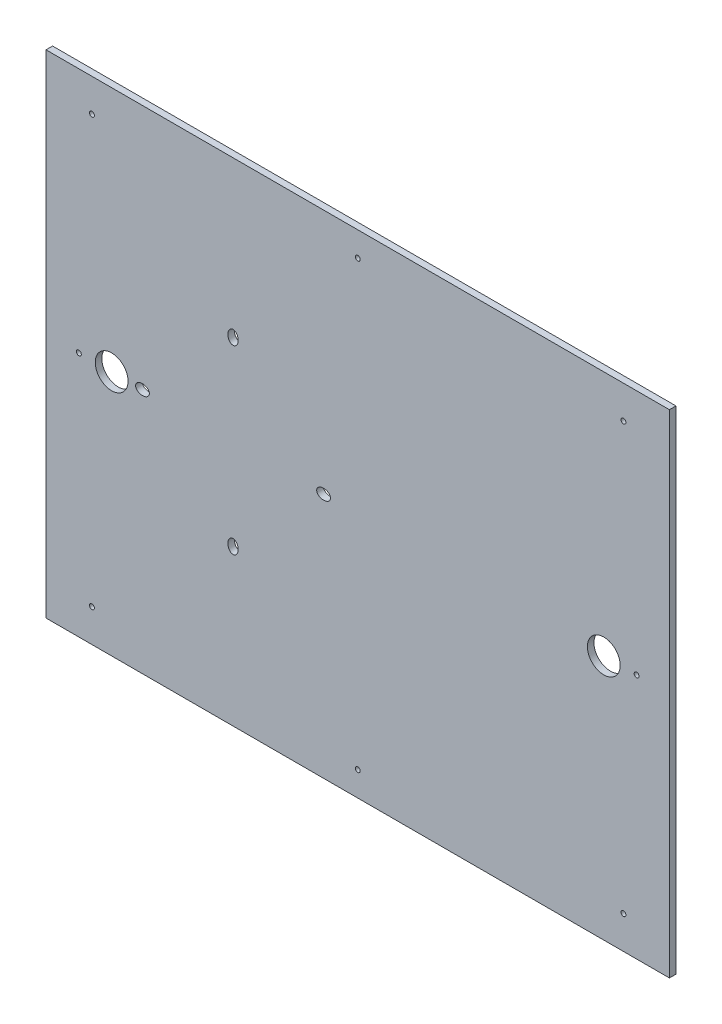
ISO-10303-21;
HEADER;
FILE_DESCRIPTION(('STEP AP214'),'2;1');
FILE_NAME('part.step','',(''),(''),'','','');
FILE_SCHEMA(('AUTOMOTIVE_DESIGN { 1 0 10303 214 1 1 1 1 }'));
ENDSEC;
DATA;
#1=APPLICATION_CONTEXT('core data for automotive mechanical design processes');
#2=APPLICATION_PROTOCOL_DEFINITION('international standard','automotive_design',2000,#1);
#3=PRODUCT_CONTEXT('',#1,'mechanical');
#4=PRODUCT('Part','Part','',(#3));
#5=PRODUCT_RELATED_PRODUCT_CATEGORY('part','',(#4));
#6=PRODUCT_DEFINITION_FORMATION('','',#4);
#7=PRODUCT_DEFINITION_CONTEXT('part definition',#1,'design');
#8=PRODUCT_DEFINITION('design','',#6,#7);
#9=PRODUCT_DEFINITION_SHAPE('','',#8);
#10=(LENGTH_UNIT() NAMED_UNIT(*) SI_UNIT(.MILLI.,.METRE.));
#11=(NAMED_UNIT(*) PLANE_ANGLE_UNIT() SI_UNIT($,.RADIAN.));
#12=(NAMED_UNIT(*) SI_UNIT($,.STERADIAN.) SOLID_ANGLE_UNIT());
#13=UNCERTAINTY_MEASURE_WITH_UNIT(LENGTH_MEASURE(1.E-05),#10,'distance_accuracy_value','');
#14=(GEOMETRIC_REPRESENTATION_CONTEXT(3) GLOBAL_UNCERTAINTY_ASSIGNED_CONTEXT((#13)) GLOBAL_UNIT_ASSIGNED_CONTEXT((#10,
#11,#12)) REPRESENTATION_CONTEXT('',''));
#15=CARTESIAN_POINT('',(0.,0.,0.));
#16=DIRECTION('',(0.,0.,1.));
#17=DIRECTION('',(1.,0.,0.));
#18=AXIS2_PLACEMENT_3D('',#15,#16,#17);
#19=CARTESIAN_POINT('',(-313.14988176555,-102.236334851958,4.));
#20=DIRECTION('',(1.,0.,0.));
#21=DIRECTION('',(0.,0.,-1.));
#22=AXIS2_PLACEMENT_3D('',#19,#20,#21);
#23=PLANE('',#22);
#24=DIRECTION('',(0.,-1.,0.));
#25=VECTOR('',#24,1.);
#26=CARTESIAN_POINT('',(-313.14988176555,-102.236334851958,0.));
#27=LINE('',#26,#25);
#28=CARTESIAN_POINT('',(-313.14988176555,197.763665148042,0.));
#29=VERTEX_POINT('',#28);
#30=CARTESIAN_POINT('',(-313.14988176555,-102.236334851958,0.));
#31=VERTEX_POINT('',#30);
#32=EDGE_CURVE('E98',#29,#31,#27,.T.);
#33=ORIENTED_EDGE('',*,*,#32,.T.);
#34=DIRECTION('',(0.,0.,-1.));
#35=VECTOR('',#34,1.);
#36=CARTESIAN_POINT('',(-313.14988176555,-102.236334851958,4.));
#37=LINE('',#36,#35);
#38=CARTESIAN_POINT('',(-313.14988176555,-102.236334851958,4.));
#39=VERTEX_POINT('',#38);
#40=EDGE_CURVE('E11',#39,#31,#37,.T.);
#41=ORIENTED_EDGE('',*,*,#40,.F.);
#42=DIRECTION('',(0.,-1.,0.));
#43=VECTOR('',#42,1.);
#44=CARTESIAN_POINT('',(-313.14988176555,-102.236334851958,4.));
#45=LINE('',#44,#43);
#46=CARTESIAN_POINT('',(-313.14988176555,197.763665148042,4.));
#47=VERTEX_POINT('',#46);
#48=EDGE_CURVE('E85',#47,#39,#45,.T.);
#49=ORIENTED_EDGE('',*,*,#48,.F.);
#50=DIRECTION('',(0.,0.,-1.));
#51=VECTOR('',#50,1.);
#52=CARTESIAN_POINT('',(-313.14988176555,197.763665148042,4.));
#53=LINE('',#52,#51);
#54=EDGE_CURVE('E94',#47,#29,#53,.T.);
#55=ORIENTED_EDGE('',*,*,#54,.T.);
#56=EDGE_LOOP('',(#33,#41,#49,#55));
#57=FACE_BOUND('',#56,.T.);
#58=ADVANCED_FACE('F33',(#57),#23,.F.);
#59=CARTESIAN_POINT('',(66.85011823445,-102.236334851958,4.));
#60=DIRECTION('',(0.,1.,0.));
#61=DIRECTION('',(0.,0.,1.));
#62=AXIS2_PLACEMENT_3D('',#59,#60,#61);
#63=PLANE('',#62);
#64=DIRECTION('',(1.,0.,0.));
#65=VECTOR('',#64,1.);
#66=CARTESIAN_POINT('',(66.85011823445,-102.236334851958,0.));
#67=LINE('',#66,#65);
#68=CARTESIAN_POINT('',(66.85011823445,-102.236334851958,0.));
#69=VERTEX_POINT('',#68);
#70=EDGE_CURVE('E89',#31,#69,#67,.T.);
#71=ORIENTED_EDGE('',*,*,#70,.T.);
#72=DIRECTION('',(0.,0.,-1.));
#73=VECTOR('',#72,1.);
#74=CARTESIAN_POINT('',(66.85011823445,-102.236334851958,4.));
#75=LINE('',#74,#73);
#76=CARTESIAN_POINT('',(66.85011823445,-102.236334851958,4.));
#77=VERTEX_POINT('',#76);
#78=EDGE_CURVE('E42',#77,#69,#75,.T.);
#79=ORIENTED_EDGE('',*,*,#78,.F.);
#80=DIRECTION('',(1.,0.,0.));
#81=VECTOR('',#80,1.);
#82=CARTESIAN_POINT('',(66.85011823445,-102.236334851958,4.));
#83=LINE('',#82,#81);
#84=EDGE_CURVE('E80',#39,#77,#83,.T.);
#85=ORIENTED_EDGE('',*,*,#84,.F.);
#86=ORIENTED_EDGE('',*,*,#40,.T.);
#87=EDGE_LOOP('',(#71,#79,#85,#86));
#88=FACE_BOUND('',#87,.T.);
#89=ADVANCED_FACE('F88',(#88),#63,.F.);
#90=CARTESIAN_POINT('',(66.85011823445,197.763665148042,4.));
#91=DIRECTION('',(-1.,0.,0.));
#92=DIRECTION('',(0.,0.,1.));
#93=AXIS2_PLACEMENT_3D('',#90,#91,#92);
#94=PLANE('',#93);
#95=DIRECTION('',(0.,1.,0.));
#96=VECTOR('',#95,1.);
#97=CARTESIAN_POINT('',(66.85011823445,197.763665148042,0.));
#98=LINE('',#97,#96);
#99=CARTESIAN_POINT('',(66.85011823445,197.763665148042,0.));
#100=VERTEX_POINT('',#99);
#101=EDGE_CURVE('E67',#69,#100,#98,.T.);
#102=ORIENTED_EDGE('',*,*,#101,.T.);
#103=DIRECTION('',(0.,0.,-1.));
#104=VECTOR('',#103,1.);
#105=CARTESIAN_POINT('',(66.85011823445,197.763665148042,4.));
#106=LINE('',#105,#104);
#107=CARTESIAN_POINT('',(66.85011823445,197.763665148042,4.));
#108=VERTEX_POINT('',#107);
#109=EDGE_CURVE('E90',#108,#100,#106,.T.);
#110=ORIENTED_EDGE('',*,*,#109,.F.);
#111=DIRECTION('',(0.,1.,0.));
#112=VECTOR('',#111,1.);
#113=CARTESIAN_POINT('',(66.85011823445,197.763665148042,4.));
#114=LINE('',#113,#112);
#115=EDGE_CURVE('E83',#77,#108,#114,.T.);
#116=ORIENTED_EDGE('',*,*,#115,.F.);
#117=ORIENTED_EDGE('',*,*,#78,.T.);
#118=EDGE_LOOP('',(#102,#110,#116,#117));
#119=FACE_BOUND('',#118,.T.);
#120=ADVANCED_FACE('F92',(#119),#94,.F.);
#121=CARTESIAN_POINT('',(-313.14988176555,197.763665148042,4.));
#122=DIRECTION('',(0.,-1.,0.));
#123=DIRECTION('',(0.,0.,-1.));
#124=AXIS2_PLACEMENT_3D('',#121,#122,#123);
#125=PLANE('',#124);
#126=DIRECTION('',(-1.,0.,0.));
#127=VECTOR('',#126,1.);
#128=CARTESIAN_POINT('',(-313.14988176555,197.763665148042,0.));
#129=LINE('',#128,#127);
#130=EDGE_CURVE('E73',#100,#29,#129,.T.);
#131=ORIENTED_EDGE('',*,*,#130,.T.);
#132=ORIENTED_EDGE('',*,*,#54,.F.);
#133=DIRECTION('',(-1.,0.,0.));
#134=VECTOR('',#133,1.);
#135=CARTESIAN_POINT('',(-313.14988176555,197.763665148042,4.));
#136=LINE('',#135,#134);
#137=EDGE_CURVE('E50',#108,#47,#136,.T.);
#138=ORIENTED_EDGE('',*,*,#137,.F.);
#139=ORIENTED_EDGE('',*,*,#109,.T.);
#140=EDGE_LOOP('',(#131,#132,#138,#139));
#141=FACE_BOUND('',#140,.T.);
#142=ADVANCED_FACE('F106',(#141),#125,.F.);
#143=CARTESIAN_POINT('',(0.,0.,4.));
#144=DIRECTION('',(0.,0.,-1.));
#145=DIRECTION('',(-1.,0.,0.));
#146=AXIS2_PLACEMENT_3D('',#143,#144,#145);
#147=PLANE('',#146);
#148=CARTESIAN_POINT('',(-254.34988176555,47.7636651480415,4.));
#149=DIRECTION('',(0.,0.,-1.));
#150=DIRECTION('',(1.,0.,0.));
#151=AXIS2_PLACEMENT_3D('',#148,#149,#150);
#152=ELLIPSE('',#151,4.20000000000004,3.14999999999999);
#153=CARTESIAN_POINT('',(-250.14988176555,47.7636651480415,4.));
#154=VERTEX_POINT('',#153);
#155=EDGE_CURVE('E370',#154,#154,#152,.T.);
#156=ORIENTED_EDGE('',*,*,#155,.T.);
#157=EDGE_LOOP('',(#156));
#158=FACE_BOUND('',#157,.T.);
#159=CARTESIAN_POINT('',(-199.14988176555,102.963665148042,4.));
#160=DIRECTION('',(0.,0.,-1.));
#161=DIRECTION('',(0.,-1.,0.));
#162=AXIS2_PLACEMENT_3D('',#159,#160,#161);
#163=ELLIPSE('',#162,4.20000000000001,3.14999999999999);
#164=CARTESIAN_POINT('',(-199.14988176555,98.7636651480421,4.));
#165=VERTEX_POINT('',#164);
#166=EDGE_CURVE('E377',#165,#165,#163,.T.);
#167=ORIENTED_EDGE('',*,*,#166,.T.);
#168=EDGE_LOOP('',(#167));
#169=FACE_BOUND('',#168,.T.);
#170=CARTESIAN_POINT('',(-143.94988176555,47.7636651480422,4.));
#171=DIRECTION('',(0.,0.,-1.));
#172=DIRECTION('',(-1.,0.,0.));
#173=AXIS2_PLACEMENT_3D('',#170,#171,#172);
#174=ELLIPSE('',#173,4.20000000000001,3.14999999999999);
#175=CARTESIAN_POINT('',(-148.14988176555,47.7636651480422,4.));
#176=VERTEX_POINT('',#175);
#177=EDGE_CURVE('E172',#176,#176,#174,.T.);
#178=ORIENTED_EDGE('',*,*,#177,.T.);
#179=EDGE_LOOP('',(#178));
#180=FACE_BOUND('',#179,.T.);
#181=CARTESIAN_POINT('',(-199.14988176555,-7.43633485195794,4.));
#182=DIRECTION('',(0.,0.,-1.));
#183=DIRECTION('',(0.,1.,0.));
#184=AXIS2_PLACEMENT_3D('',#181,#182,#183);
#185=ELLIPSE('',#184,4.20000000000002,3.14999999999999);
#186=CARTESIAN_POINT('',(-199.14988176555,-3.23633485195792,4.));
#187=VERTEX_POINT('',#186);
#188=EDGE_CURVE('E166',#187,#187,#185,.T.);
#189=ORIENTED_EDGE('',*,*,#188,.T.);
#190=EDGE_LOOP('',(#189));
#191=FACE_BOUND('',#190,.T.);
#192=CARTESIAN_POINT('',(-123.149881765551,-87.2363348519579,4.));
#193=DIRECTION('',(0.,0.,-1.));
#194=DIRECTION('',(-1.,0.,0.));
#195=AXIS2_PLACEMENT_3D('',#192,#193,#194);
#196=CIRCLE('',#195,1.5);
#197=CARTESIAN_POINT('',(-124.649881765551,-87.2363348519579,4.));
#198=VERTEX_POINT('',#197);
#199=EDGE_CURVE('E160',#198,#198,#196,.T.);
#200=ORIENTED_EDGE('',*,*,#199,.T.);
#201=EDGE_LOOP('',(#200));
#202=FACE_BOUND('',#201,.T.);
#203=CARTESIAN_POINT('',(46.85011823445,47.7636651480409,4.));
#204=DIRECTION('',(0.,0.,-1.));
#205=DIRECTION('',(-1.,0.,0.));
#206=AXIS2_PLACEMENT_3D('',#203,#204,#205);
#207=CIRCLE('',#206,1.5);
#208=CARTESIAN_POINT('',(45.35011823445,47.7636651480409,4.));
#209=VERTEX_POINT('',#208);
#210=EDGE_CURVE('E154',#209,#209,#207,.T.);
#211=ORIENTED_EDGE('',*,*,#210,.T.);
#212=EDGE_LOOP('',(#211));
#213=FACE_BOUND('',#212,.T.);
#214=CARTESIAN_POINT('',(-123.14988176555,182.763665148042,4.));
#215=DIRECTION('',(0.,0.,-1.));
#216=DIRECTION('',(-1.,0.,0.));
#217=AXIS2_PLACEMENT_3D('',#214,#215,#216);
#218=CIRCLE('',#217,1.5);
#219=CARTESIAN_POINT('',(-124.64988176555,182.763665148042,4.));
#220=VERTEX_POINT('',#219);
#221=EDGE_CURVE('E148',#220,#220,#218,.T.);
#222=ORIENTED_EDGE('',*,*,#221,.T.);
#223=EDGE_LOOP('',(#222));
#224=FACE_BOUND('',#223,.T.);
#225=CARTESIAN_POINT('',(-293.14988176555,47.7636651480421,4.));
#226=DIRECTION('',(0.,0.,-1.));
#227=DIRECTION('',(-1.,0.,0.));
#228=AXIS2_PLACEMENT_3D('',#225,#226,#227);
#229=CIRCLE('',#228,1.50000000000002);
#230=CARTESIAN_POINT('',(-294.64988176555,47.7636651480421,4.));
#231=VERTEX_POINT('',#230);
#232=EDGE_CURVE('E142',#231,#231,#229,.T.);
#233=ORIENTED_EDGE('',*,*,#232,.T.);
#234=EDGE_LOOP('',(#233));
#235=FACE_BOUND('',#234,.T.);
#236=CARTESIAN_POINT('',(38.85011823445,177.76366514804,4.));
#237=DIRECTION('',(0.,0.,-1.));
#238=DIRECTION('',(-1.,0.,0.));
#239=AXIS2_PLACEMENT_3D('',#236,#237,#238);
#240=CIRCLE('',#239,1.50000000000002);
#241=CARTESIAN_POINT('',(37.35011823445,177.76366514804,4.));
#242=VERTEX_POINT('',#241);
#243=EDGE_CURVE('E139',#242,#242,#240,.T.);
#244=ORIENTED_EDGE('',*,*,#243,.T.);
#245=EDGE_LOOP('',(#244));
#246=FACE_BOUND('',#245,.T.);
#247=CARTESIAN_POINT('',(38.8501182344473,-82.2363348519602,4.));
#248=DIRECTION('',(0.,0.,-1.));
#249=DIRECTION('',(-1.,0.,0.));
#250=AXIS2_PLACEMENT_3D('',#247,#248,#249);
#251=CIRCLE('',#250,1.50000000000002);
#252=CARTESIAN_POINT('',(37.3501182344473,-82.2363348519602,4.));
#253=VERTEX_POINT('',#252);
#254=EDGE_CURVE('E133',#253,#253,#251,.T.);
#255=ORIENTED_EDGE('',*,*,#254,.T.);
#256=EDGE_LOOP('',(#255));
#257=FACE_BOUND('',#256,.T.);
#258=CARTESIAN_POINT('',(-285.149881765553,-82.2363348519579,4.));
#259=DIRECTION('',(0.,0.,-1.));
#260=DIRECTION('',(-1.,0.,0.));
#261=AXIS2_PLACEMENT_3D('',#258,#259,#260);
#262=CIRCLE('',#261,1.50000000000002);
#263=CARTESIAN_POINT('',(-286.649881765553,-82.2363348519579,4.));
#264=VERTEX_POINT('',#263);
#265=EDGE_CURVE('E127',#264,#264,#262,.T.);
#266=ORIENTED_EDGE('',*,*,#265,.T.);
#267=EDGE_LOOP('',(#266));
#268=FACE_BOUND('',#267,.T.);
#269=CARTESIAN_POINT('',(-285.14988176555,177.763665148042,4.));
#270=DIRECTION('',(0.,0.,-1.));
#271=DIRECTION('',(-1.,0.,0.));
#272=AXIS2_PLACEMENT_3D('',#269,#270,#271);
#273=CIRCLE('',#272,1.50000000000002);
#274=CARTESIAN_POINT('',(-286.64988176555,177.763665148042,4.));
#275=VERTEX_POINT('',#274);
#276=EDGE_CURVE('E120',#275,#275,#273,.T.);
#277=ORIENTED_EDGE('',*,*,#276,.T.);
#278=EDGE_LOOP('',(#277));
#279=FACE_BOUND('',#278,.T.);
#280=CARTESIAN_POINT('',(-273.14988176555,47.7636651480421,4.));
#281=DIRECTION('',(0.,0.,1.));
#282=DIRECTION('',(1.,0.,0.));
#283=AXIS2_PLACEMENT_3D('',#280,#281,#282);
#284=CIRCLE('',#283,10.);
#285=CARTESIAN_POINT('',(-263.14988176555,47.7636651480421,4.));
#286=VERTEX_POINT('',#285);
#287=EDGE_CURVE('E117',#286,#286,#284,.T.);
#288=ORIENTED_EDGE('',*,*,#287,.F.);
#289=EDGE_LOOP('',(#288));
#290=FACE_BOUND('',#289,.T.);
#291=CARTESIAN_POINT('',(26.85011823445,47.7636651480421,4.));
#292=DIRECTION('',(0.,0.,1.));
#293=DIRECTION('',(1.,0.,0.));
#294=AXIS2_PLACEMENT_3D('',#291,#292,#293);
#295=CIRCLE('',#294,10.);
#296=CARTESIAN_POINT('',(36.85011823445,47.7636651480421,4.));
#297=VERTEX_POINT('',#296);
#298=EDGE_CURVE('E114',#297,#297,#295,.T.);
#299=ORIENTED_EDGE('',*,*,#298,.F.);
#300=EDGE_LOOP('',(#299));
#301=FACE_BOUND('',#300,.T.);
#302=ORIENTED_EDGE('',*,*,#48,.T.);
#303=ORIENTED_EDGE('',*,*,#84,.T.);
#304=ORIENTED_EDGE('',*,*,#115,.T.);
#305=ORIENTED_EDGE('',*,*,#137,.T.);
#306=EDGE_LOOP('',(#302,#303,#304,#305));
#307=FACE_BOUND('',#306,.T.);
#308=ADVANCED_FACE('F81',(#158,#169,#180,#191,#202,#213,#224,#235,#246,#257,#268,#279,#290,#301,
#307),#147,.F.);
#309=CARTESIAN_POINT('',(0.,0.,0.));
#310=DIRECTION('',(0.,0.,-1.));
#311=DIRECTION('',(-1.,0.,0.));
#312=AXIS2_PLACEMENT_3D('',#309,#310,#311);
#313=PLANE('',#312);
#314=CARTESIAN_POINT('',(-254.34988176555,47.7636651480415,0.));
#315=DIRECTION('',(0.,0.,-1.));
#316=DIRECTION('',(1.,0.,0.));
#317=AXIS2_PLACEMENT_3D('',#314,#315,#316);
#318=ELLIPSE('',#317,4.20000000000004,3.14999999999999);
#319=CARTESIAN_POINT('',(-250.14988176555,47.7636651480415,0.));
#320=VERTEX_POINT('',#319);
#321=EDGE_CURVE('E375',#320,#320,#318,.T.);
#322=ORIENTED_EDGE('',*,*,#321,.F.);
#323=EDGE_LOOP('',(#322));
#324=FACE_BOUND('',#323,.T.);
#325=CARTESIAN_POINT('',(-199.14988176555,102.963665148042,0.));
#326=DIRECTION('',(0.,0.,-1.));
#327=DIRECTION('',(0.,-1.,0.));
#328=AXIS2_PLACEMENT_3D('',#325,#326,#327);
#329=ELLIPSE('',#328,4.20000000000001,3.14999999999999);
#330=CARTESIAN_POINT('',(-199.14988176555,98.7636651480421,0.));
#331=VERTEX_POINT('',#330);
#332=EDGE_CURVE('E374',#331,#331,#329,.T.);
#333=ORIENTED_EDGE('',*,*,#332,.F.);
#334=EDGE_LOOP('',(#333));
#335=FACE_BOUND('',#334,.T.);
#336=CARTESIAN_POINT('',(-143.94988176555,47.7636651480422,0.));
#337=DIRECTION('',(0.,0.,-1.));
#338=DIRECTION('',(-1.,0.,0.));
#339=AXIS2_PLACEMENT_3D('',#336,#337,#338);
#340=ELLIPSE('',#339,4.20000000000001,3.14999999999999);
#341=CARTESIAN_POINT('',(-148.14988176555,47.7636651480422,0.));
#342=VERTEX_POINT('',#341);
#343=EDGE_CURVE('E176',#342,#342,#340,.T.);
#344=ORIENTED_EDGE('',*,*,#343,.F.);
#345=EDGE_LOOP('',(#344));
#346=FACE_BOUND('',#345,.T.);
#347=CARTESIAN_POINT('',(-199.14988176555,-7.43633485195794,0.));
#348=DIRECTION('',(0.,0.,-1.));
#349=DIRECTION('',(0.,1.,0.));
#350=AXIS2_PLACEMENT_3D('',#347,#348,#349);
#351=ELLIPSE('',#350,4.20000000000002,3.14999999999999);
#352=CARTESIAN_POINT('',(-199.14988176555,-3.23633485195792,0.));
#353=VERTEX_POINT('',#352);
#354=EDGE_CURVE('E169',#353,#353,#351,.T.);
#355=ORIENTED_EDGE('',*,*,#354,.F.);
#356=EDGE_LOOP('',(#355));
#357=FACE_BOUND('',#356,.T.);
#358=CARTESIAN_POINT('',(-123.149881765551,-87.2363348519579,0.));
#359=DIRECTION('',(0.,0.,-1.));
#360=DIRECTION('',(-1.,0.,0.));
#361=AXIS2_PLACEMENT_3D('',#358,#359,#360);
#362=CIRCLE('',#361,1.5);
#363=CARTESIAN_POINT('',(-124.649881765551,-87.2363348519579,0.));
#364=VERTEX_POINT('',#363);
#365=EDGE_CURVE('E163',#364,#364,#362,.T.);
#366=ORIENTED_EDGE('',*,*,#365,.F.);
#367=EDGE_LOOP('',(#366));
#368=FACE_BOUND('',#367,.T.);
#369=CARTESIAN_POINT('',(46.85011823445,47.7636651480409,0.));
#370=DIRECTION('',(0.,0.,-1.));
#371=DIRECTION('',(-1.,0.,0.));
#372=AXIS2_PLACEMENT_3D('',#369,#370,#371);
#373=CIRCLE('',#372,1.5);
#374=CARTESIAN_POINT('',(45.35011823445,47.7636651480409,0.));
#375=VERTEX_POINT('',#374);
#376=EDGE_CURVE('E157',#375,#375,#373,.T.);
#377=ORIENTED_EDGE('',*,*,#376,.F.);
#378=EDGE_LOOP('',(#377));
#379=FACE_BOUND('',#378,.T.);
#380=CARTESIAN_POINT('',(-123.14988176555,182.763665148042,0.));
#381=DIRECTION('',(0.,0.,-1.));
#382=DIRECTION('',(-1.,0.,0.));
#383=AXIS2_PLACEMENT_3D('',#380,#381,#382);
#384=CIRCLE('',#383,1.5);
#385=CARTESIAN_POINT('',(-124.64988176555,182.763665148042,0.));
#386=VERTEX_POINT('',#385);
#387=EDGE_CURVE('E151',#386,#386,#384,.T.);
#388=ORIENTED_EDGE('',*,*,#387,.F.);
#389=EDGE_LOOP('',(#388));
#390=FACE_BOUND('',#389,.T.);
#391=CARTESIAN_POINT('',(-293.14988176555,47.7636651480421,0.));
#392=DIRECTION('',(0.,0.,-1.));
#393=DIRECTION('',(-1.,0.,0.));
#394=AXIS2_PLACEMENT_3D('',#391,#392,#393);
#395=CIRCLE('',#394,1.50000000000002);
#396=CARTESIAN_POINT('',(-294.64988176555,47.7636651480421,0.));
#397=VERTEX_POINT('',#396);
#398=EDGE_CURVE('E145',#397,#397,#395,.T.);
#399=ORIENTED_EDGE('',*,*,#398,.F.);
#400=EDGE_LOOP('',(#399));
#401=FACE_BOUND('',#400,.T.);
#402=CARTESIAN_POINT('',(38.85011823445,177.76366514804,0.));
#403=DIRECTION('',(0.,0.,-1.));
#404=DIRECTION('',(-1.,0.,0.));
#405=AXIS2_PLACEMENT_3D('',#402,#403,#404);
#406=CIRCLE('',#405,1.50000000000002);
#407=CARTESIAN_POINT('',(37.35011823445,177.76366514804,0.));
#408=VERTEX_POINT('',#407);
#409=EDGE_CURVE('E136',#408,#408,#406,.T.);
#410=ORIENTED_EDGE('',*,*,#409,.F.);
#411=EDGE_LOOP('',(#410));
#412=FACE_BOUND('',#411,.T.);
#413=CARTESIAN_POINT('',(38.8501182344473,-82.2363348519602,0.));
#414=DIRECTION('',(0.,0.,-1.));
#415=DIRECTION('',(-1.,0.,0.));
#416=AXIS2_PLACEMENT_3D('',#413,#414,#415);
#417=CIRCLE('',#416,1.50000000000002);
#418=CARTESIAN_POINT('',(37.3501182344473,-82.2363348519602,0.));
#419=VERTEX_POINT('',#418);
#420=EDGE_CURVE('E130',#419,#419,#417,.T.);
#421=ORIENTED_EDGE('',*,*,#420,.F.);
#422=EDGE_LOOP('',(#421));
#423=FACE_BOUND('',#422,.T.);
#424=CARTESIAN_POINT('',(-285.149881765553,-82.2363348519579,0.));
#425=DIRECTION('',(0.,0.,-1.));
#426=DIRECTION('',(-1.,0.,0.));
#427=AXIS2_PLACEMENT_3D('',#424,#425,#426);
#428=CIRCLE('',#427,1.50000000000002);
#429=CARTESIAN_POINT('',(-286.649881765553,-82.2363348519579,0.));
#430=VERTEX_POINT('',#429);
#431=EDGE_CURVE('E124',#430,#430,#428,.T.);
#432=ORIENTED_EDGE('',*,*,#431,.F.);
#433=EDGE_LOOP('',(#432));
#434=FACE_BOUND('',#433,.T.);
#435=CARTESIAN_POINT('',(-285.14988176555,177.763665148042,0.));
#436=DIRECTION('',(0.,0.,-1.));
#437=DIRECTION('',(-1.,0.,0.));
#438=AXIS2_PLACEMENT_3D('',#435,#436,#437);
#439=CIRCLE('',#438,1.50000000000002);
#440=CARTESIAN_POINT('',(-286.64988176555,177.763665148042,0.));
#441=VERTEX_POINT('',#440);
#442=EDGE_CURVE('E121',#441,#441,#439,.T.);
#443=ORIENTED_EDGE('',*,*,#442,.F.);
#444=EDGE_LOOP('',(#443));
#445=FACE_BOUND('',#444,.T.);
#446=CARTESIAN_POINT('',(-273.14988176555,47.7636651480421,0.));
#447=DIRECTION('',(0.,0.,-1.));
#448=DIRECTION('',(-1.,0.,0.));
#449=AXIS2_PLACEMENT_3D('',#446,#447,#448);
#450=CIRCLE('',#449,10.);
#451=CARTESIAN_POINT('',(-283.14988176555,47.7636651480421,0.));
#452=VERTEX_POINT('',#451);
#453=EDGE_CURVE('E36',#452,#452,#450,.T.);
#454=ORIENTED_EDGE('',*,*,#453,.F.);
#455=EDGE_LOOP('',(#454));
#456=FACE_BOUND('',#455,.T.);
#457=CARTESIAN_POINT('',(26.85011823445,47.7636651480421,0.));
#458=DIRECTION('',(0.,0.,-1.));
#459=DIRECTION('',(-1.,0.,0.));
#460=AXIS2_PLACEMENT_3D('',#457,#458,#459);
#461=CIRCLE('',#460,10.);
#462=CARTESIAN_POINT('',(16.85011823445,47.7636651480421,0.));
#463=VERTEX_POINT('',#462);
#464=EDGE_CURVE('E101',#463,#463,#461,.T.);
#465=ORIENTED_EDGE('',*,*,#464,.F.);
#466=EDGE_LOOP('',(#465));
#467=FACE_BOUND('',#466,.T.);
#468=ORIENTED_EDGE('',*,*,#32,.F.);
#469=ORIENTED_EDGE('',*,*,#130,.F.);
#470=ORIENTED_EDGE('',*,*,#101,.F.);
#471=ORIENTED_EDGE('',*,*,#70,.F.);
#472=EDGE_LOOP('',(#468,#469,#470,#471));
#473=FACE_BOUND('',#472,.T.);
#474=ADVANCED_FACE('F109',(#324,#335,#346,#357,#368,#379,#390,#401,#412,#423,#434,#445,#456,
#467,#473),#313,.T.);
#475=CARTESIAN_POINT('',(26.85011823445,47.7636651480421,4.));
#476=DIRECTION('',(0.,0.,1.));
#477=DIRECTION('',(1.,0.,0.));
#478=AXIS2_PLACEMENT_3D('',#475,#476,#477);
#479=CYLINDRICAL_SURFACE('',#478,10.);
#480=ORIENTED_EDGE('',*,*,#464,.T.);
#481=EDGE_LOOP('',(#480));
#482=FACE_BOUND('',#481,.T.);
#483=ORIENTED_EDGE('',*,*,#298,.T.);
#484=EDGE_LOOP('',(#483));
#485=FACE_BOUND('',#484,.T.);
#486=ADVANCED_FACE('F221',(#482,#485),#479,.F.);
#487=CARTESIAN_POINT('',(-273.14988176555,47.7636651480421,4.));
#488=DIRECTION('',(0.,0.,1.));
#489=DIRECTION('',(1.,0.,0.));
#490=AXIS2_PLACEMENT_3D('',#487,#488,#489);
#491=CYLINDRICAL_SURFACE('',#490,10.);
#492=ORIENTED_EDGE('',*,*,#453,.T.);
#493=EDGE_LOOP('',(#492));
#494=FACE_BOUND('',#493,.T.);
#495=ORIENTED_EDGE('',*,*,#287,.T.);
#496=EDGE_LOOP('',(#495));
#497=FACE_BOUND('',#496,.T.);
#498=ADVANCED_FACE('F217',(#494,#497),#491,.F.);
#499=CARTESIAN_POINT('',(-285.14988176555,177.763665148042,4.));
#500=DIRECTION('',(0.,0.,-1.));
#501=DIRECTION('',(-1.,0.,0.));
#502=AXIS2_PLACEMENT_3D('',#499,#500,#501);
#503=CYLINDRICAL_SURFACE('',#502,1.50000000000002);
#504=ORIENTED_EDGE('',*,*,#276,.F.);
#505=EDGE_LOOP('',(#504));
#506=FACE_BOUND('',#505,.T.);
#507=ORIENTED_EDGE('',*,*,#442,.T.);
#508=EDGE_LOOP('',(#507));
#509=FACE_BOUND('',#508,.T.);
#510=ADVANCED_FACE('F213',(#506,#509),#503,.F.);
#511=CARTESIAN_POINT('',(-285.149881765553,-82.2363348519579,4.));
#512=DIRECTION('',(0.,0.,-1.));
#513=DIRECTION('',(-1.,0.,0.));
#514=AXIS2_PLACEMENT_3D('',#511,#512,#513);
#515=CYLINDRICAL_SURFACE('',#514,1.50000000000002);
#516=ORIENTED_EDGE('',*,*,#265,.F.);
#517=EDGE_LOOP('',(#516));
#518=FACE_BOUND('',#517,.T.);
#519=ORIENTED_EDGE('',*,*,#431,.T.);
#520=EDGE_LOOP('',(#519));
#521=FACE_BOUND('',#520,.T.);
#522=ADVANCED_FACE('F209',(#518,#521),#515,.F.);
#523=CARTESIAN_POINT('',(38.8501182344473,-82.2363348519602,4.));
#524=DIRECTION('',(0.,0.,-1.));
#525=DIRECTION('',(-1.,0.,0.));
#526=AXIS2_PLACEMENT_3D('',#523,#524,#525);
#527=CYLINDRICAL_SURFACE('',#526,1.50000000000002);
#528=ORIENTED_EDGE('',*,*,#254,.F.);
#529=EDGE_LOOP('',(#528));
#530=FACE_BOUND('',#529,.T.);
#531=ORIENTED_EDGE('',*,*,#420,.T.);
#532=EDGE_LOOP('',(#531));
#533=FACE_BOUND('',#532,.T.);
#534=ADVANCED_FACE('F205',(#530,#533),#527,.F.);
#535=CARTESIAN_POINT('',(38.85011823445,177.76366514804,4.));
#536=DIRECTION('',(0.,0.,-1.));
#537=DIRECTION('',(-1.,0.,0.));
#538=AXIS2_PLACEMENT_3D('',#535,#536,#537);
#539=CYLINDRICAL_SURFACE('',#538,1.50000000000002);
#540=ORIENTED_EDGE('',*,*,#243,.F.);
#541=EDGE_LOOP('',(#540));
#542=FACE_BOUND('',#541,.T.);
#543=ORIENTED_EDGE('',*,*,#409,.T.);
#544=EDGE_LOOP('',(#543));
#545=FACE_BOUND('',#544,.T.);
#546=ADVANCED_FACE('F201',(#542,#545),#539,.F.);
#547=CARTESIAN_POINT('',(-293.14988176555,47.7636651480421,4.));
#548=DIRECTION('',(0.,0.,-1.));
#549=DIRECTION('',(-1.,0.,0.));
#550=AXIS2_PLACEMENT_3D('',#547,#548,#549);
#551=CYLINDRICAL_SURFACE('',#550,1.50000000000002);
#552=ORIENTED_EDGE('',*,*,#232,.F.);
#553=EDGE_LOOP('',(#552));
#554=FACE_BOUND('',#553,.T.);
#555=ORIENTED_EDGE('',*,*,#398,.T.);
#556=EDGE_LOOP('',(#555));
#557=FACE_BOUND('',#556,.T.);
#558=ADVANCED_FACE('F197',(#554,#557),#551,.F.);
#559=CARTESIAN_POINT('',(-123.14988176555,182.763665148042,4.));
#560=DIRECTION('',(0.,0.,-1.));
#561=DIRECTION('',(-1.,0.,0.));
#562=AXIS2_PLACEMENT_3D('',#559,#560,#561);
#563=CYLINDRICAL_SURFACE('',#562,1.5);
#564=ORIENTED_EDGE('',*,*,#221,.F.);
#565=EDGE_LOOP('',(#564));
#566=FACE_BOUND('',#565,.T.);
#567=ORIENTED_EDGE('',*,*,#387,.T.);
#568=EDGE_LOOP('',(#567));
#569=FACE_BOUND('',#568,.T.);
#570=ADVANCED_FACE('F193',(#566,#569),#563,.F.);
#571=CARTESIAN_POINT('',(46.85011823445,47.7636651480409,4.));
#572=DIRECTION('',(0.,0.,-1.));
#573=DIRECTION('',(-1.,0.,0.));
#574=AXIS2_PLACEMENT_3D('',#571,#572,#573);
#575=CYLINDRICAL_SURFACE('',#574,1.5);
#576=ORIENTED_EDGE('',*,*,#210,.F.);
#577=EDGE_LOOP('',(#576));
#578=FACE_BOUND('',#577,.T.);
#579=ORIENTED_EDGE('',*,*,#376,.T.);
#580=EDGE_LOOP('',(#579));
#581=FACE_BOUND('',#580,.T.);
#582=ADVANCED_FACE('F189',(#578,#581),#575,.F.);
#583=CARTESIAN_POINT('',(-123.149881765551,-87.2363348519579,4.));
#584=DIRECTION('',(0.,0.,-1.));
#585=DIRECTION('',(-1.,0.,0.));
#586=AXIS2_PLACEMENT_3D('',#583,#584,#585);
#587=CYLINDRICAL_SURFACE('',#586,1.5);
#588=ORIENTED_EDGE('',*,*,#199,.F.);
#589=EDGE_LOOP('',(#588));
#590=FACE_BOUND('',#589,.T.);
#591=ORIENTED_EDGE('',*,*,#365,.T.);
#592=EDGE_LOOP('',(#591));
#593=FACE_BOUND('',#592,.T.);
#594=ADVANCED_FACE('F184',(#590,#593),#587,.F.);
#595=DIRECTION('',(0.,0.,-1.));
#596=VECTOR('',#595,1.);
#597=SURFACE_OF_LINEAR_EXTRUSION('',#185,#596);
#598=ORIENTED_EDGE('',*,*,#188,.F.);
#599=EDGE_LOOP('',(#598));
#600=FACE_BOUND('',#599,.T.);
#601=ORIENTED_EDGE('',*,*,#354,.T.);
#602=EDGE_LOOP('',(#601));
#603=FACE_BOUND('',#602,.T.);
#604=ADVANCED_FACE('F179',(#600,#603),#597,.F.);
#605=DIRECTION('',(0.,0.,-1.));
#606=VECTOR('',#605,1.);
#607=SURFACE_OF_LINEAR_EXTRUSION('',#174,#606);
#608=ORIENTED_EDGE('',*,*,#177,.F.);
#609=EDGE_LOOP('',(#608));
#610=FACE_BOUND('',#609,.T.);
#611=ORIENTED_EDGE('',*,*,#343,.T.);
#612=EDGE_LOOP('',(#611));
#613=FACE_BOUND('',#612,.T.);
#614=ADVANCED_FACE('F183',(#610,#613),#607,.F.);
#615=DIRECTION('',(0.,0.,-1.));
#616=VECTOR('',#615,1.);
#617=SURFACE_OF_LINEAR_EXTRUSION('',#163,#616);
#618=ORIENTED_EDGE('',*,*,#166,.F.);
#619=EDGE_LOOP('',(#618));
#620=FACE_BOUND('',#619,.T.);
#621=ORIENTED_EDGE('',*,*,#332,.T.);
#622=EDGE_LOOP('',(#621));
#623=FACE_BOUND('',#622,.T.);
#624=ADVANCED_FACE('F344',(#620,#623),#617,.F.);
#625=DIRECTION('',(0.,0.,-1.));
#626=VECTOR('',#625,1.);
#627=SURFACE_OF_LINEAR_EXTRUSION('',#152,#626);
#628=ORIENTED_EDGE('',*,*,#155,.F.);
#629=EDGE_LOOP('',(#628));
#630=FACE_BOUND('',#629,.T.);
#631=ORIENTED_EDGE('',*,*,#321,.T.);
#632=EDGE_LOOP('',(#631));
#633=FACE_BOUND('',#632,.T.);
#634=ADVANCED_FACE('F353',(#630,#633),#627,.F.);
#635=CLOSED_SHELL('',(#58,#89,#120,#142,#308,#474,#486,#498,#510,#522,#534,#546,#558,#570,#582,
#594,#604,#614,#624,#634));
#636=MANIFOLD_SOLID_BREP('B2',#635);
#637=ADVANCED_BREP_SHAPE_REPRESENTATION('',(#18,#636),#14);
#638=SHAPE_DEFINITION_REPRESENTATION(#9,#637);
ENDSEC;
END-ISO-10303-21;
